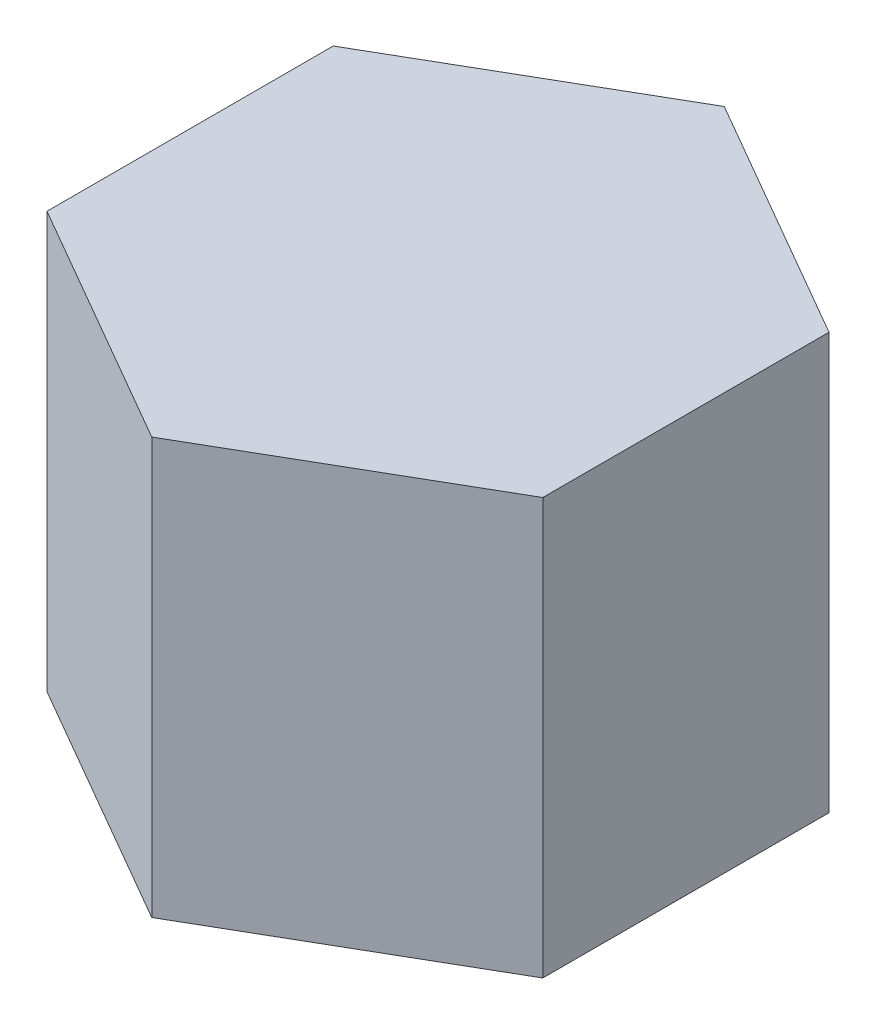
ISO-10303-21;
HEADER;
FILE_DESCRIPTION(('STEP AP214'),'2;1');
FILE_NAME('part.step','',(''),(''),'','','');
FILE_SCHEMA(('AUTOMOTIVE_DESIGN { 1 0 10303 214 1 1 1 1 }'));
ENDSEC;
DATA;
#1=APPLICATION_CONTEXT('core data for automotive mechanical design processes');
#2=APPLICATION_PROTOCOL_DEFINITION('international standard','automotive_design',2000,#1);
#3=PRODUCT_CONTEXT('',#1,'mechanical');
#4=PRODUCT('Part','Part','',(#3));
#5=PRODUCT_RELATED_PRODUCT_CATEGORY('part','',(#4));
#6=PRODUCT_DEFINITION_FORMATION('','',#4);
#7=PRODUCT_DEFINITION_CONTEXT('part definition',#1,'design');
#8=PRODUCT_DEFINITION('design','',#6,#7);
#9=PRODUCT_DEFINITION_SHAPE('','',#8);
#10=(LENGTH_UNIT() NAMED_UNIT(*) SI_UNIT(.MILLI.,.METRE.));
#11=(NAMED_UNIT(*) PLANE_ANGLE_UNIT() SI_UNIT($,.RADIAN.));
#12=(NAMED_UNIT(*) SI_UNIT($,.STERADIAN.) SOLID_ANGLE_UNIT());
#13=UNCERTAINTY_MEASURE_WITH_UNIT(LENGTH_MEASURE(1.E-05),#10,'distance_accuracy_value','');
#14=(GEOMETRIC_REPRESENTATION_CONTEXT(3) GLOBAL_UNCERTAINTY_ASSIGNED_CONTEXT((#13)) GLOBAL_UNIT_ASSIGNED_CONTEXT((#10,
#11,#12)) REPRESENTATION_CONTEXT('',''));
#15=CARTESIAN_POINT('',(0.,0.,0.));
#16=DIRECTION('',(0.,0.,1.));
#17=DIRECTION('',(1.,0.,0.));
#18=AXIS2_PLACEMENT_3D('',#15,#16,#17);
#19=CARTESIAN_POINT('',(202.339551417382,-147.556598747966,291.681971220494));
#20=DIRECTION('',(-0.500000000000096,0.,-0.866025403784383));
#21=DIRECTION('',(-0.866025403784383,0.,0.500000000000096));
#22=AXIS2_PLACEMENT_3D('',#19,#20,#21);
#23=PLANE('',#22);
#24=CARTESIAN_POINT('',(202.642660308706,-147.047793579175,291.506971220494));
#25=DIRECTION('',(-0.866025403784383,0.,0.500000000000096));
#26=VECTOR('',#25,1.);
#27=LINE('',#24,#26);
#28=CARTESIAN_POINT('',(202.642660308706,-147.047793579175,291.506971220494));
#29=VERTEX_POINT('',#28);
#30=CARTESIAN_POINT('',(202.339551417382,-147.047793579175,291.681971220494));
#31=VERTEX_POINT('',#30);
#32=EDGE_CURVE('E170',#29,#31,#27,.T.);
#33=ORIENTED_EDGE('',*,*,#32,.T.);
#34=CARTESIAN_POINT('',(202.339551417382,-147.556598747966,291.681971220494));
#35=DIRECTION('',(0.,1.,0.));
#36=VECTOR('',#35,1.);
#37=LINE('',#34,#36);
#38=CARTESIAN_POINT('',(202.339551417382,-147.556598747966,291.681971220494));
#39=VERTEX_POINT('',#38);
#40=EDGE_CURVE('E35',#39,#31,#37,.T.);
#41=ORIENTED_EDGE('',*,*,#40,.F.);
#42=CARTESIAN_POINT('',(202.642660308706,-147.556598747966,291.506971220494));
#43=DIRECTION('',(-0.866025403784383,0.,0.500000000000096));
#44=VECTOR('',#43,1.);
#45=LINE('',#42,#44);
#46=CARTESIAN_POINT('',(202.642660308706,-147.556598747966,291.506971220494));
#47=VERTEX_POINT('',#46);
#48=EDGE_CURVE('E159',#47,#39,#45,.T.);
#49=ORIENTED_EDGE('',*,*,#48,.F.);
#50=CARTESIAN_POINT('',(202.642660308706,-147.556598747966,291.506971220494));
#51=DIRECTION('',(0.,1.,0.));
#52=VECTOR('',#51,1.);
#53=LINE('',#50,#52);
#54=EDGE_CURVE('E10',#47,#29,#53,.T.);
#55=ORIENTED_EDGE('',*,*,#54,.T.);
#56=EDGE_LOOP('',(#33,#41,#49,#55));
#57=FACE_BOUND('',#56,.T.);
#58=ADVANCED_FACE('F16',(#57),#23,.F.);
#59=CARTESIAN_POINT('',(202.642660308706,-147.556598747966,291.594471220494));
#60=DIRECTION('',(-1.,0.,0.));
#61=DIRECTION('',(0.,-1.,0.));
#62=AXIS2_PLACEMENT_3D('',#59,#60,#61);
#63=PLANE('',#62);
#64=CARTESIAN_POINT('',(202.642660308706,-147.047793579175,291.156971220494));
#65=DIRECTION('',(0.,0.,1.));
#66=VECTOR('',#65,1.);
#67=LINE('',#64,#66);
#68=CARTESIAN_POINT('',(202.642660308706,-147.047793579175,291.156971220494));
#69=VERTEX_POINT('',#68);
#70=EDGE_CURVE('E167',#69,#29,#67,.T.);
#71=ORIENTED_EDGE('',*,*,#70,.T.);
#72=ORIENTED_EDGE('',*,*,#54,.F.);
#73=CARTESIAN_POINT('',(202.642660308706,-147.556598747966,291.156971220494));
#74=DIRECTION('',(0.,0.,1.));
#75=VECTOR('',#74,1.);
#76=LINE('',#73,#75);
#77=CARTESIAN_POINT('',(202.642660308706,-147.556598747966,291.156971220494));
#78=VERTEX_POINT('',#77);
#79=EDGE_CURVE('E156',#78,#47,#76,.T.);
#80=ORIENTED_EDGE('',*,*,#79,.F.);
#81=CARTESIAN_POINT('',(202.642660308706,-147.556598747966,291.156971220494));
#82=DIRECTION('',(0.,1.,0.));
#83=VECTOR('',#82,1.);
#84=LINE('',#81,#83);
#85=EDGE_CURVE('E27',#78,#69,#84,.T.);
#86=ORIENTED_EDGE('',*,*,#85,.T.);
#87=EDGE_LOOP('',(#71,#72,#80,#86));
#88=FACE_BOUND('',#87,.T.);
#89=ADVANCED_FACE('F189',(#88),#63,.F.);
#90=CARTESIAN_POINT('',(202.642660308706,-147.556598747966,291.156971220494));
#91=DIRECTION('',(-0.499999999999909,0.,0.866025403784491));
#92=DIRECTION('',(0.866025403784491,0.,0.499999999999909));
#93=AXIS2_PLACEMENT_3D('',#90,#91,#92);
#94=PLANE('',#93);
#95=CARTESIAN_POINT('',(202.339551417381,-147.047793579175,290.981971220494));
#96=DIRECTION('',(0.866025403784491,0.,0.499999999999909));
#97=VECTOR('',#96,1.);
#98=LINE('',#95,#97);
#99=CARTESIAN_POINT('',(202.339551417382,-147.047793579175,290.981971220494));
#100=VERTEX_POINT('',#99);
#101=EDGE_CURVE('E163',#100,#69,#98,.T.);
#102=ORIENTED_EDGE('',*,*,#101,.T.);
#103=ORIENTED_EDGE('',*,*,#85,.F.);
#104=CARTESIAN_POINT('',(202.339551417381,-147.556598747966,290.981971220494));
#105=DIRECTION('',(0.866025403784491,0.,0.499999999999909));
#106=VECTOR('',#105,1.);
#107=LINE('',#104,#106);
#108=CARTESIAN_POINT('',(202.339551417382,-147.556598747966,290.981971220494));
#109=VERTEX_POINT('',#108);
#110=EDGE_CURVE('E106',#109,#78,#107,.T.);
#111=ORIENTED_EDGE('',*,*,#110,.F.);
#112=CARTESIAN_POINT('',(202.339551417381,-147.556598747966,290.981971220494));
#113=DIRECTION('',(0.,1.,0.));
#114=VECTOR('',#113,1.);
#115=LINE('',#112,#114);
#116=EDGE_CURVE('E94',#109,#100,#115,.T.);
#117=ORIENTED_EDGE('',*,*,#116,.T.);
#118=EDGE_LOOP('',(#102,#103,#111,#117));
#119=FACE_BOUND('',#118,.T.);
#120=ADVANCED_FACE('F198',(#119),#94,.F.);
#121=CARTESIAN_POINT('',(202.339551417382,-147.556598747966,290.981971220494));
#122=DIRECTION('',(0.500000000000096,0.,0.866025403784383));
#123=DIRECTION('',(0.866025403784383,0.,-0.500000000000096));
#124=AXIS2_PLACEMENT_3D('',#121,#122,#123);
#125=PLANE('',#124);
#126=CARTESIAN_POINT('',(202.036442526057,-147.047793579175,291.156971220494));
#127=DIRECTION('',(0.866025403784383,0.,-0.500000000000096));
#128=VECTOR('',#127,1.);
#129=LINE('',#126,#128);
#130=CARTESIAN_POINT('',(202.036442526057,-147.047793579175,291.156971220494));
#131=VERTEX_POINT('',#130);
#132=EDGE_CURVE('E162',#131,#100,#129,.T.);
#133=ORIENTED_EDGE('',*,*,#132,.T.);
#134=ORIENTED_EDGE('',*,*,#116,.F.);
#135=CARTESIAN_POINT('',(202.036442526057,-147.556598747966,291.156971220494));
#136=DIRECTION('',(0.866025403784383,0.,-0.500000000000096));
#137=VECTOR('',#136,1.);
#138=LINE('',#135,#137);
#139=CARTESIAN_POINT('',(202.036442526057,-147.556598747966,291.156971220494));
#140=VERTEX_POINT('',#139);
#141=EDGE_CURVE('E98',#140,#109,#138,.T.);
#142=ORIENTED_EDGE('',*,*,#141,.F.);
#143=CARTESIAN_POINT('',(202.036442526057,-147.556598747966,291.156971220494));
#144=DIRECTION('',(0.,1.,0.));
#145=VECTOR('',#144,1.);
#146=LINE('',#143,#145);
#147=EDGE_CURVE('E79',#140,#131,#146,.T.);
#148=ORIENTED_EDGE('',*,*,#147,.T.);
#149=EDGE_LOOP('',(#133,#134,#142,#148));
#150=FACE_BOUND('',#149,.T.);
#151=ADVANCED_FACE('F100',(#150),#125,.F.);
#152=CARTESIAN_POINT('',(202.036442526057,-147.556598747966,291.594471220494));
#153=DIRECTION('',(1.,0.,0.));
#154=DIRECTION('',(0.,1.,0.));
#155=AXIS2_PLACEMENT_3D('',#152,#153,#154);
#156=PLANE('',#155);
#157=CARTESIAN_POINT('',(202.036442526057,-147.047793579175,291.506971220494));
#158=DIRECTION('',(0.,0.,-1.));
#159=VECTOR('',#158,1.);
#160=LINE('',#157,#159);
#161=CARTESIAN_POINT('',(202.036442526057,-147.047793579175,291.506971220494));
#162=VERTEX_POINT('',#161);
#163=EDGE_CURVE('E88',#162,#131,#160,.T.);
#164=ORIENTED_EDGE('',*,*,#163,.T.);
#165=ORIENTED_EDGE('',*,*,#147,.F.);
#166=CARTESIAN_POINT('',(202.036442526057,-147.556598747966,291.506971220494));
#167=DIRECTION('',(0.,0.,-1.));
#168=VECTOR('',#167,1.);
#169=LINE('',#166,#168);
#170=CARTESIAN_POINT('',(202.036442526057,-147.556598747966,291.506971220494));
#171=VERTEX_POINT('',#170);
#172=EDGE_CURVE('E84',#171,#140,#169,.T.);
#173=ORIENTED_EDGE('',*,*,#172,.F.);
#174=CARTESIAN_POINT('',(202.036442526057,-147.556598747966,291.506971220494));
#175=DIRECTION('',(0.,1.,0.));
#176=VECTOR('',#175,1.);
#177=LINE('',#174,#176);
#178=EDGE_CURVE('E58',#171,#162,#177,.T.);
#179=ORIENTED_EDGE('',*,*,#178,.T.);
#180=EDGE_LOOP('',(#164,#165,#173,#179));
#181=FACE_BOUND('',#180,.T.);
#182=ADVANCED_FACE('F82',(#181),#156,.F.);
#183=CARTESIAN_POINT('',(202.036442526057,-147.556598747966,291.506971220494));
#184=DIRECTION('',(0.499999999999978,0.,-0.866025403784452));
#185=DIRECTION('',(-0.866025403784452,0.,-0.499999999999978));
#186=AXIS2_PLACEMENT_3D('',#183,#184,#185);
#187=PLANE('',#186);
#188=CARTESIAN_POINT('',(202.339551417382,-147.047793579175,291.681971220494));
#189=DIRECTION('',(-0.866025403784452,0.,-0.499999999999978));
#190=VECTOR('',#189,1.);
#191=LINE('',#188,#190);
#192=EDGE_CURVE('E160',#31,#162,#191,.T.);
#193=ORIENTED_EDGE('',*,*,#192,.T.);
#194=ORIENTED_EDGE('',*,*,#178,.F.);
#195=CARTESIAN_POINT('',(202.339551417382,-147.556598747966,291.681971220494));
#196=DIRECTION('',(-0.866025403784452,0.,-0.499999999999978));
#197=VECTOR('',#196,1.);
#198=LINE('',#195,#197);
#199=EDGE_CURVE('E112',#39,#171,#198,.T.);
#200=ORIENTED_EDGE('',*,*,#199,.F.);
#201=ORIENTED_EDGE('',*,*,#40,.T.);
#202=EDGE_LOOP('',(#193,#194,#200,#201));
#203=FACE_BOUND('',#202,.T.);
#204=ADVANCED_FACE('F131',(#203),#187,.F.);
#205=CARTESIAN_POINT('',(206.491105863044,-147.556598747966,291.594471220494));
#206=DIRECTION('',(0.,1.,0.));
#207=DIRECTION('',(-1.,0.,0.));
#208=AXIS2_PLACEMENT_3D('',#205,#206,#207);
#209=PLANE('',#208);
#210=ORIENTED_EDGE('',*,*,#48,.T.);
#211=ORIENTED_EDGE('',*,*,#199,.T.);
#212=ORIENTED_EDGE('',*,*,#172,.T.);
#213=ORIENTED_EDGE('',*,*,#141,.T.);
#214=ORIENTED_EDGE('',*,*,#110,.T.);
#215=ORIENTED_EDGE('',*,*,#79,.T.);
#216=EDGE_LOOP('',(#210,#211,#212,#213,#214,#215));
#217=FACE_BOUND('',#216,.T.);
#218=ADVANCED_FACE('F111',(#217),#209,.F.);
#219=CARTESIAN_POINT('',(206.491105863044,-147.047793579175,291.594471220494));
#220=DIRECTION('',(0.,1.,0.));
#221=DIRECTION('',(-1.,0.,0.));
#222=AXIS2_PLACEMENT_3D('',#219,#220,#221);
#223=PLANE('',#222);
#224=ORIENTED_EDGE('',*,*,#32,.F.);
#225=ORIENTED_EDGE('',*,*,#70,.F.);
#226=ORIENTED_EDGE('',*,*,#101,.F.);
#227=ORIENTED_EDGE('',*,*,#132,.F.);
#228=ORIENTED_EDGE('',*,*,#163,.F.);
#229=ORIENTED_EDGE('',*,*,#192,.F.);
#230=EDGE_LOOP('',(#224,#225,#226,#227,#228,#229));
#231=FACE_BOUND('',#230,.T.);
#232=ADVANCED_FACE('F130',(#231),#223,.T.);
#233=CLOSED_SHELL('',(#58,#89,#120,#151,#182,#204,#218,#232));
#234=MANIFOLD_SOLID_BREP('B1',#233);
#235=ADVANCED_BREP_SHAPE_REPRESENTATION('',(#18,#234),#14);
#236=SHAPE_DEFINITION_REPRESENTATION(#9,#235);
ENDSEC;
END-ISO-10303-21;
